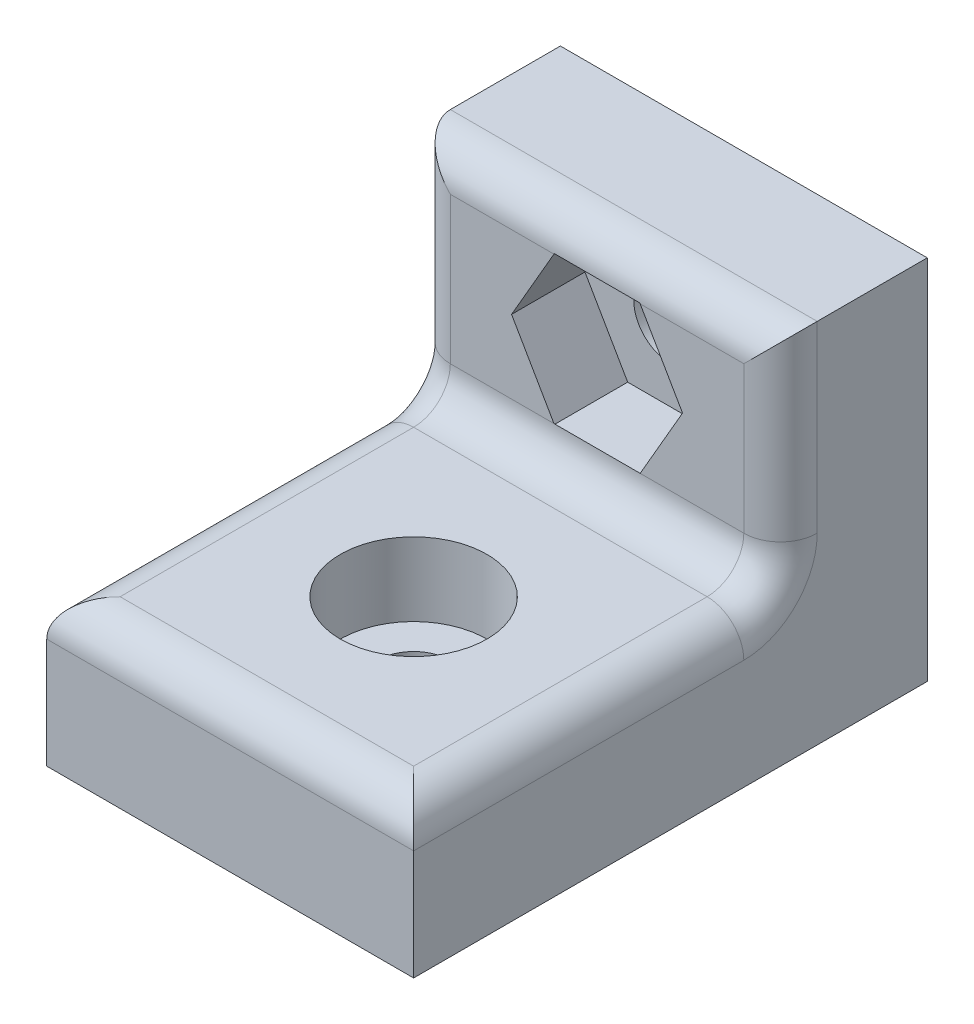
ISO-10303-21;
HEADER;
FILE_DESCRIPTION(('STEP AP214'),'2;1');
FILE_NAME('part.step','',(''),(''),'','','');
FILE_SCHEMA(('AUTOMOTIVE_DESIGN { 1 0 10303 214 1 1 1 1 }'));
ENDSEC;
DATA;
#1=APPLICATION_CONTEXT('core data for automotive mechanical design processes');
#2=APPLICATION_PROTOCOL_DEFINITION('international standard','automotive_design',2000,#1);
#3=PRODUCT_CONTEXT('',#1,'mechanical');
#4=PRODUCT('Part','Part','',(#3));
#5=PRODUCT_RELATED_PRODUCT_CATEGORY('part','',(#4));
#6=PRODUCT_DEFINITION_FORMATION('','',#4);
#7=PRODUCT_DEFINITION_CONTEXT('part definition',#1,'design');
#8=PRODUCT_DEFINITION('design','',#6,#7);
#9=PRODUCT_DEFINITION_SHAPE('','',#8);
#10=(LENGTH_UNIT() NAMED_UNIT(*) SI_UNIT(.MILLI.,.METRE.));
#11=(NAMED_UNIT(*) PLANE_ANGLE_UNIT() SI_UNIT($,.RADIAN.));
#12=(NAMED_UNIT(*) SI_UNIT($,.STERADIAN.) SOLID_ANGLE_UNIT());
#13=UNCERTAINTY_MEASURE_WITH_UNIT(LENGTH_MEASURE(1.E-05),#10,'distance_accuracy_value','');
#14=(GEOMETRIC_REPRESENTATION_CONTEXT(3) GLOBAL_UNCERTAINTY_ASSIGNED_CONTEXT((#13)) GLOBAL_UNIT_ASSIGNED_CONTEXT((#10,
#11,#12)) REPRESENTATION_CONTEXT('',''));
#15=CARTESIAN_POINT('',(0.,0.,0.));
#16=DIRECTION('',(0.,0.,1.));
#17=DIRECTION('',(1.,0.,0.));
#18=AXIS2_PLACEMENT_3D('',#15,#16,#17);
#19=CARTESIAN_POINT('',(0.,0.,9.));
#20=DIRECTION('',(0.,1.,0.));
#21=DIRECTION('',(0.,0.,1.));
#22=AXIS2_PLACEMENT_3D('',#19,#20,#21);
#23=CYLINDRICAL_SURFACE('',#22,1.);
#24=CARTESIAN_POINT('',(0.,0.,9.));
#25=DIRECTION('',(0.,1.,0.));
#26=DIRECTION('',(0.,0.,1.));
#27=AXIS2_PLACEMENT_3D('',#24,#25,#26);
#28=CIRCLE('',#27,1.);
#29=CARTESIAN_POINT('',(0.,0.,10.));
#30=VERTEX_POINT('',#29);
#31=EDGE_CURVE('E237',#30,#30,#28,.T.);
#32=ORIENTED_EDGE('',*,*,#31,.F.);
#33=EDGE_LOOP('',(#32));
#34=FACE_BOUND('',#33,.T.);
#35=CARTESIAN_POINT('',(0.,2.,9.));
#36=DIRECTION('',(0.,1.,0.));
#37=DIRECTION('',(0.,0.,1.));
#38=AXIS2_PLACEMENT_3D('',#35,#36,#37);
#39=CIRCLE('',#38,1.);
#40=CARTESIAN_POINT('',(0.,2.,10.));
#41=VERTEX_POINT('',#40);
#42=EDGE_CURVE('E42',#41,#41,#39,.F.);
#43=ORIENTED_EDGE('',*,*,#42,.F.);
#44=EDGE_LOOP('',(#43));
#45=FACE_BOUND('',#44,.T.);
#46=ADVANCED_FACE('F38',(#34,#45),#23,.F.);
#47=CARTESIAN_POINT('',(0.,0.,4.));
#48=DIRECTION('',(0.,0.,1.));
#49=DIRECTION('',(1.,0.,0.));
#50=AXIS2_PLACEMENT_3D('',#47,#48,#49);
#51=PLANE('',#50);
#52=DIRECTION('',(0.5,-0.866025403784439,0.));
#53=VECTOR('',#52,1.);
#54=CARTESIAN_POINT('',(-2.33,7.,4.));
#55=LINE('',#54,#53);
#56=CARTESIAN_POINT('',(-2.33,7.,4.));
#57=VERTEX_POINT('',#56);
#58=CARTESIAN_POINT('',(-1.17529946162075,5.,4.));
#59=VERTEX_POINT('',#58);
#60=EDGE_CURVE('E199',#57,#59,#55,.T.);
#61=ORIENTED_EDGE('',*,*,#60,.F.);
#62=DIRECTION('',(-0.5,-0.866025403784439,0.));
#63=VECTOR('',#62,1.);
#64=CARTESIAN_POINT('',(-1.165,9.01783919081774,4.));
#65=LINE('',#64,#63);
#66=CARTESIAN_POINT('',(-1.17529946162075,9.,4.));
#67=VERTEX_POINT('',#66);
#68=EDGE_CURVE('E220',#67,#57,#65,.T.);
#69=ORIENTED_EDGE('',*,*,#68,.F.);
#70=DIRECTION('',(-1.,0.,0.));
#71=VECTOR('',#70,1.);
#72=CARTESIAN_POINT('',(-5.,9.,4.));
#73=LINE('',#72,#71);
#74=CARTESIAN_POINT('',(-4.,9.,4.));
#75=VERTEX_POINT('',#74);
#76=EDGE_CURVE('E283',#67,#75,#73,.T.);
#77=ORIENTED_EDGE('',*,*,#76,.T.);
#78=DIRECTION('',(0.,-1.,0.));
#79=VECTOR('',#78,1.);
#80=CARTESIAN_POINT('',(-4.,4.,4.));
#81=LINE('',#80,#79);
#82=CARTESIAN_POINT('',(-4.,5.,4.));
#83=VERTEX_POINT('',#82);
#84=EDGE_CURVE('E278',#75,#83,#81,.T.);
#85=ORIENTED_EDGE('',*,*,#84,.T.);
#86=DIRECTION('',(-1.,0.,0.));
#87=VECTOR('',#86,1.);
#88=CARTESIAN_POINT('',(0.,5.,4.));
#89=LINE('',#88,#87);
#90=EDGE_CURVE('E275',#83,#59,#89,.F.);
#91=ORIENTED_EDGE('',*,*,#90,.T.);
#92=EDGE_LOOP('',(#61,#69,#77,#85,#91));
#93=FACE_BOUND('',#92,.T.);
#94=ADVANCED_FACE('F347',(#93),#51,.T.);
#95=CARTESIAN_POINT('',(0.,7.,0.));
#96=DIRECTION('',(0.,0.,1.));
#97=DIRECTION('',(1.,0.,0.));
#98=AXIS2_PLACEMENT_3D('',#95,#96,#97);
#99=CYLINDRICAL_SURFACE('',#98,1.);
#100=CARTESIAN_POINT('',(0.,7.,0.));
#101=DIRECTION('',(0.,0.,1.));
#102=DIRECTION('',(1.,0.,0.));
#103=AXIS2_PLACEMENT_3D('',#100,#101,#102);
#104=CIRCLE('',#103,1.);
#105=CARTESIAN_POINT('',(1.,7.,0.));
#106=VERTEX_POINT('',#105);
#107=EDGE_CURVE('E241',#106,#106,#104,.T.);
#108=ORIENTED_EDGE('',*,*,#107,.F.);
#109=EDGE_LOOP('',(#108));
#110=FACE_BOUND('',#109,.T.);
#111=CARTESIAN_POINT('',(0.,7.,2.));
#112=DIRECTION('',(0.,0.,1.));
#113=DIRECTION('',(1.,0.,0.));
#114=AXIS2_PLACEMENT_3D('',#111,#112,#113);
#115=CIRCLE('',#114,1.);
#116=CARTESIAN_POINT('',(1.,7.,2.));
#117=VERTEX_POINT('',#116);
#118=EDGE_CURVE('E236',#117,#117,#115,.F.);
#119=ORIENTED_EDGE('',*,*,#118,.F.);
#120=EDGE_LOOP('',(#119));
#121=FACE_BOUND('',#120,.T.);
#122=ADVANCED_FACE('F344',(#110,#121),#99,.F.);
#123=CARTESIAN_POINT('',(-5.,10.,4.));
#124=DIRECTION('',(1.,0.,0.));
#125=DIRECTION('',(0.,1.,0.));
#126=AXIS2_PLACEMENT_3D('',#123,#124,#125);
#127=PLANE('',#126);
#128=CARTESIAN_POINT('',(-5.,5.,5.));
#129=DIRECTION('',(1.,0.,0.));
#130=DIRECTION('',(0.,1.,0.));
#131=AXIS2_PLACEMENT_3D('',#128,#129,#130);
#132=CIRCLE('',#131,2.);
#133=CARTESIAN_POINT('',(-5.,5.,3.));
#134=VERTEX_POINT('',#133);
#135=CARTESIAN_POINT('',(-5.,3.,5.));
#136=VERTEX_POINT('',#135);
#137=EDGE_CURVE('E295',#134,#136,#132,.F.);
#138=ORIENTED_EDGE('',*,*,#137,.F.);
#139=DIRECTION('',(0.,-1.,0.));
#140=VECTOR('',#139,1.);
#141=CARTESIAN_POINT('',(-5.,10.,3.));
#142=LINE('',#141,#140);
#143=CARTESIAN_POINT('',(-5.,10.,3.));
#144=VERTEX_POINT('',#143);
#145=EDGE_CURVE('E300',#134,#144,#142,.F.);
#146=ORIENTED_EDGE('',*,*,#145,.T.);
#147=DIRECTION('',(0.,0.,-1.));
#148=VECTOR('',#147,1.);
#149=CARTESIAN_POINT('',(-5.,10.,4.));
#150=LINE('',#149,#148);
#151=CARTESIAN_POINT('',(-5.,10.,0.));
#152=VERTEX_POINT('',#151);
#153=EDGE_CURVE('E264',#144,#152,#150,.T.);
#154=ORIENTED_EDGE('',*,*,#153,.T.);
#155=DIRECTION('',(0.,-1.,0.));
#156=VECTOR('',#155,1.);
#157=CARTESIAN_POINT('',(-5.,10.,0.));
#158=LINE('',#157,#156);
#159=CARTESIAN_POINT('',(-5.,0.,0.));
#160=VERTEX_POINT('',#159);
#161=EDGE_CURVE('E253',#152,#160,#158,.T.);
#162=ORIENTED_EDGE('',*,*,#161,.T.);
#163=DIRECTION('',(0.,0.,-1.));
#164=VECTOR('',#163,1.);
#165=CARTESIAN_POINT('',(-5.,0.,4.));
#166=LINE('',#165,#164);
#167=CARTESIAN_POINT('',(-5.,0.,14.));
#168=VERTEX_POINT('',#167);
#169=EDGE_CURVE('E271',#168,#160,#166,.T.);
#170=ORIENTED_EDGE('',*,*,#169,.F.);
#171=DIRECTION('',(0.,-1.,0.));
#172=VECTOR('',#171,1.);
#173=CARTESIAN_POINT('',(-5.,0.,14.));
#174=LINE('',#173,#172);
#175=CARTESIAN_POINT('',(-5.,3.,14.));
#176=VERTEX_POINT('',#175);
#177=EDGE_CURVE('E244',#176,#168,#174,.T.);
#178=ORIENTED_EDGE('',*,*,#177,.F.);
#179=DIRECTION('',(0.,0.,-1.));
#180=VECTOR('',#179,1.);
#181=CARTESIAN_POINT('',(-5.,3.,4.));
#182=LINE('',#181,#180);
#183=EDGE_CURVE('E298',#176,#136,#182,.T.);
#184=ORIENTED_EDGE('',*,*,#183,.T.);
#185=EDGE_LOOP('',(#138,#146,#154,#162,#170,#178,#184));
#186=FACE_BOUND('',#185,.T.);
#187=ADVANCED_FACE('F346',(#186),#127,.F.);
#188=CARTESIAN_POINT('',(-5.,0.,4.));
#189=DIRECTION('',(0.,1.,0.));
#190=DIRECTION('',(0.,0.,1.));
#191=AXIS2_PLACEMENT_3D('',#188,#189,#190);
#192=PLANE('',#191);
#193=ORIENTED_EDGE('',*,*,#31,.T.);
#194=EDGE_LOOP('',(#193));
#195=FACE_BOUND('',#194,.T.);
#196=DIRECTION('',(1.,0.,0.));
#197=VECTOR('',#196,1.);
#198=CARTESIAN_POINT('',(-5.,0.,0.));
#199=LINE('',#198,#197);
#200=CARTESIAN_POINT('',(5.,0.,0.));
#201=VERTEX_POINT('',#200);
#202=EDGE_CURVE('E256',#160,#201,#199,.T.);
#203=ORIENTED_EDGE('',*,*,#202,.T.);
#204=DIRECTION('',(0.,0.,-1.));
#205=VECTOR('',#204,1.);
#206=CARTESIAN_POINT('',(5.,0.,4.));
#207=LINE('',#206,#205);
#208=CARTESIAN_POINT('',(5.,0.,14.));
#209=VERTEX_POINT('',#208);
#210=EDGE_CURVE('E268',#209,#201,#207,.T.);
#211=ORIENTED_EDGE('',*,*,#210,.F.);
#212=DIRECTION('',(1.,0.,0.));
#213=VECTOR('',#212,1.);
#214=CARTESIAN_POINT('',(-5.,0.,14.));
#215=LINE('',#214,#213);
#216=EDGE_CURVE('E247',#168,#209,#215,.T.);
#217=ORIENTED_EDGE('',*,*,#216,.F.);
#218=ORIENTED_EDGE('',*,*,#169,.T.);
#219=EDGE_LOOP('',(#203,#211,#217,#218));
#220=FACE_BOUND('',#219,.T.);
#221=ADVANCED_FACE('F354',(#195,#220),#192,.F.);
#222=CARTESIAN_POINT('',(5.,10.,4.));
#223=DIRECTION('',(-1.,0.,0.));
#224=DIRECTION('',(0.,-1.,0.));
#225=AXIS2_PLACEMENT_3D('',#222,#223,#224);
#226=PLANE('',#225);
#227=DIRECTION('',(0.,0.,-1.));
#228=VECTOR('',#227,1.);
#229=CARTESIAN_POINT('',(5.,10.,4.));
#230=LINE('',#229,#228);
#231=CARTESIAN_POINT('',(5.,10.,3.));
#232=VERTEX_POINT('',#231);
#233=CARTESIAN_POINT('',(5.,10.,0.));
#234=VERTEX_POINT('',#233);
#235=EDGE_CURVE('E266',#232,#234,#230,.T.);
#236=ORIENTED_EDGE('',*,*,#235,.F.);
#237=DIRECTION('',(0.,1.,0.));
#238=VECTOR('',#237,1.);
#239=CARTESIAN_POINT('',(5.,4.,3.));
#240=LINE('',#239,#238);
#241=CARTESIAN_POINT('',(5.,5.,3.));
#242=VERTEX_POINT('',#241);
#243=EDGE_CURVE('E292',#232,#242,#240,.F.);
#244=ORIENTED_EDGE('',*,*,#243,.T.);
#245=CARTESIAN_POINT('',(5.,5.,5.));
#246=DIRECTION('',(-1.,0.,0.));
#247=DIRECTION('',(0.,-1.,0.));
#248=AXIS2_PLACEMENT_3D('',#245,#246,#247);
#249=CIRCLE('',#248,2.);
#250=CARTESIAN_POINT('',(5.,3.,5.));
#251=VERTEX_POINT('',#250);
#252=EDGE_CURVE('E289',#251,#242,#249,.F.);
#253=ORIENTED_EDGE('',*,*,#252,.F.);
#254=DIRECTION('',(0.,0.,-1.));
#255=VECTOR('',#254,1.);
#256=CARTESIAN_POINT('',(5.,3.,4.));
#257=LINE('',#256,#255);
#258=CARTESIAN_POINT('',(5.,3.,14.));
#259=VERTEX_POINT('',#258);
#260=EDGE_CURVE('E287',#251,#259,#257,.F.);
#261=ORIENTED_EDGE('',*,*,#260,.T.);
#262=DIRECTION('',(0.,1.,0.));
#263=VECTOR('',#262,1.);
#264=CARTESIAN_POINT('',(5.,0.,14.));
#265=LINE('',#264,#263);
#266=EDGE_CURVE('E250',#209,#259,#265,.T.);
#267=ORIENTED_EDGE('',*,*,#266,.F.);
#268=ORIENTED_EDGE('',*,*,#210,.T.);
#269=DIRECTION('',(0.,1.,0.));
#270=VECTOR('',#269,1.);
#271=CARTESIAN_POINT('',(5.,10.,0.));
#272=LINE('',#271,#270);
#273=EDGE_CURVE('E258',#201,#234,#272,.T.);
#274=ORIENTED_EDGE('',*,*,#273,.T.);
#275=EDGE_LOOP('',(#236,#244,#253,#261,#267,#268,#274));
#276=FACE_BOUND('',#275,.T.);
#277=ADVANCED_FACE('F456',(#276),#226,.F.);
#278=CARTESIAN_POINT('',(-5.,10.,4.));
#279=DIRECTION('',(0.,-1.,0.));
#280=DIRECTION('',(0.,0.,-1.));
#281=AXIS2_PLACEMENT_3D('',#278,#279,#280);
#282=PLANE('',#281);
#283=ORIENTED_EDGE('',*,*,#153,.F.);
#284=DIRECTION('',(-1.,0.,0.));
#285=VECTOR('',#284,1.);
#286=CARTESIAN_POINT('',(5.,10.,3.));
#287=LINE('',#286,#285);
#288=EDGE_CURVE('E302',#144,#232,#287,.F.);
#289=ORIENTED_EDGE('',*,*,#288,.T.);
#290=ORIENTED_EDGE('',*,*,#235,.T.);
#291=DIRECTION('',(-1.,0.,0.));
#292=VECTOR('',#291,1.);
#293=CARTESIAN_POINT('',(-5.,10.,0.));
#294=LINE('',#293,#292);
#295=EDGE_CURVE('E261',#234,#152,#294,.T.);
#296=ORIENTED_EDGE('',*,*,#295,.T.);
#297=EDGE_LOOP('',(#283,#289,#290,#296));
#298=FACE_BOUND('',#297,.T.);
#299=ADVANCED_FACE('F463',(#298),#282,.F.);
#300=DIRECTION('',(-0.5,0.866025403784439,0.));
#301=VECTOR('',#300,1.);
#302=CARTESIAN_POINT('',(2.33,7.,4.));
#303=LINE('',#302,#301);
#304=CARTESIAN_POINT('',(2.33,7.,4.));
#305=VERTEX_POINT('',#304);
#306=CARTESIAN_POINT('',(1.17529946162075,9.,4.));
#307=VERTEX_POINT('',#306);
#308=EDGE_CURVE('E55',#305,#307,#303,.T.);
#309=ORIENTED_EDGE('',*,*,#308,.F.);
#310=DIRECTION('',(0.5,0.866025403784439,0.));
#311=VECTOR('',#310,1.);
#312=CARTESIAN_POINT('',(1.165,4.98216080918226,4.));
#313=LINE('',#312,#311);
#314=CARTESIAN_POINT('',(1.17529946162075,5.,4.));
#315=VERTEX_POINT('',#314);
#316=EDGE_CURVE('E216',#315,#305,#313,.T.);
#317=ORIENTED_EDGE('',*,*,#316,.F.);
#318=CARTESIAN_POINT('',(4.,5.,4.));
#319=VERTEX_POINT('',#318);
#320=EDGE_CURVE('E274',#315,#319,#89,.F.);
#321=ORIENTED_EDGE('',*,*,#320,.T.);
#322=DIRECTION('',(0.,1.,0.));
#323=VECTOR('',#322,1.);
#324=CARTESIAN_POINT('',(4.,10.,4.));
#325=LINE('',#324,#323);
#326=CARTESIAN_POINT('',(4.,9.,4.));
#327=VERTEX_POINT('',#326);
#328=EDGE_CURVE('E280',#319,#327,#325,.T.);
#329=ORIENTED_EDGE('',*,*,#328,.T.);
#330=EDGE_CURVE('E284',#327,#307,#73,.T.);
#331=ORIENTED_EDGE('',*,*,#330,.T.);
#332=EDGE_LOOP('',(#309,#317,#321,#329,#331));
#333=FACE_BOUND('',#332,.T.);
#334=ADVANCED_FACE('F359',(#333),#51,.T.);
#335=CARTESIAN_POINT('',(0.,0.,0.));
#336=DIRECTION('',(0.,0.,1.));
#337=DIRECTION('',(1.,0.,0.));
#338=AXIS2_PLACEMENT_3D('',#335,#336,#337);
#339=PLANE('',#338);
#340=ORIENTED_EDGE('',*,*,#107,.T.);
#341=EDGE_LOOP('',(#340));
#342=FACE_BOUND('',#341,.T.);
#343=ORIENTED_EDGE('',*,*,#161,.F.);
#344=ORIENTED_EDGE('',*,*,#295,.F.);
#345=ORIENTED_EDGE('',*,*,#273,.F.);
#346=ORIENTED_EDGE('',*,*,#202,.F.);
#347=EDGE_LOOP('',(#343,#344,#345,#346));
#348=FACE_BOUND('',#347,.T.);
#349=ADVANCED_FACE('F419',(#342,#348),#339,.F.);
#350=CARTESIAN_POINT('',(-5.,4.,14.));
#351=DIRECTION('',(0.,-1.,0.));
#352=DIRECTION('',(0.,0.,-1.));
#353=AXIS2_PLACEMENT_3D('',#350,#351,#352);
#354=PLANE('',#353);
#355=CARTESIAN_POINT('',(0.,4.,9.));
#356=DIRECTION('',(0.,1.,0.));
#357=DIRECTION('',(0.,0.,1.));
#358=AXIS2_PLACEMENT_3D('',#355,#356,#357);
#359=CIRCLE('',#358,2.);
#360=CARTESIAN_POINT('',(0.,4.,11.));
#361=VERTEX_POINT('',#360);
#362=EDGE_CURVE('E205',#361,#361,#359,.T.);
#363=ORIENTED_EDGE('',*,*,#362,.F.);
#364=EDGE_LOOP('',(#363));
#365=FACE_BOUND('',#364,.T.);
#366=DIRECTION('',(0.,0.,-1.));
#367=VECTOR('',#366,1.);
#368=CARTESIAN_POINT('',(-4.,4.,14.));
#369=LINE('',#368,#367);
#370=CARTESIAN_POINT('',(-4.,4.,5.));
#371=VERTEX_POINT('',#370);
#372=CARTESIAN_POINT('',(-4.,4.,13.));
#373=VERTEX_POINT('',#372);
#374=EDGE_CURVE('E308',#371,#373,#369,.F.);
#375=ORIENTED_EDGE('',*,*,#374,.T.);
#376=DIRECTION('',(-1.,0.,0.));
#377=VECTOR('',#376,1.);
#378=CARTESIAN_POINT('',(-5.,4.,13.));
#379=LINE('',#378,#377);
#380=CARTESIAN_POINT('',(4.,4.,13.));
#381=VERTEX_POINT('',#380);
#382=EDGE_CURVE('E311',#373,#381,#379,.F.);
#383=ORIENTED_EDGE('',*,*,#382,.T.);
#384=DIRECTION('',(0.,0.,-1.));
#385=VECTOR('',#384,1.);
#386=CARTESIAN_POINT('',(4.,4.,14.));
#387=LINE('',#386,#385);
#388=CARTESIAN_POINT('',(4.,4.,5.));
#389=VERTEX_POINT('',#388);
#390=EDGE_CURVE('E63',#381,#389,#387,.T.);
#391=ORIENTED_EDGE('',*,*,#390,.T.);
#392=DIRECTION('',(-1.,0.,0.));
#393=VECTOR('',#392,1.);
#394=CARTESIAN_POINT('',(-5.,4.,5.));
#395=LINE('',#394,#393);
#396=EDGE_CURVE('E306',#389,#371,#395,.T.);
#397=ORIENTED_EDGE('',*,*,#396,.T.);
#398=EDGE_LOOP('',(#375,#383,#391,#397));
#399=FACE_BOUND('',#398,.T.);
#400=ADVANCED_FACE('F415',(#365,#399),#354,.F.);
#401=CARTESIAN_POINT('',(0.,0.,14.));
#402=DIRECTION('',(0.,0.,-1.));
#403=DIRECTION('',(-1.,0.,0.));
#404=AXIS2_PLACEMENT_3D('',#401,#402,#403);
#405=PLANE('',#404);
#406=ORIENTED_EDGE('',*,*,#266,.T.);
#407=DIRECTION('',(-1.,0.,0.));
#408=VECTOR('',#407,1.);
#409=CARTESIAN_POINT('',(0.,3.,14.));
#410=LINE('',#409,#408);
#411=EDGE_CURVE('E304',#259,#176,#410,.T.);
#412=ORIENTED_EDGE('',*,*,#411,.T.);
#413=ORIENTED_EDGE('',*,*,#177,.T.);
#414=ORIENTED_EDGE('',*,*,#216,.T.);
#415=EDGE_LOOP('',(#406,#412,#413,#414));
#416=FACE_BOUND('',#415,.T.);
#417=ADVANCED_FACE('F418',(#416),#405,.F.);
#418=CARTESIAN_POINT('',(-4.,3.,4.));
#419=DIRECTION('',(0.,0.,-1.));
#420=DIRECTION('',(-1.,0.,0.));
#421=AXIS2_PLACEMENT_3D('',#418,#419,#420);
#422=CYLINDRICAL_SURFACE('',#421,1.);
#423=CARTESIAN_POINT('',(-4.,3.,5.));
#424=DIRECTION('',(0.,0.,-1.));
#425=DIRECTION('',(-1.,0.,0.));
#426=AXIS2_PLACEMENT_3D('',#423,#424,#425);
#427=CIRCLE('',#426,1.);
#428=EDGE_CURVE('E335',#136,#371,#427,.T.);
#429=ORIENTED_EDGE('',*,*,#428,.F.);
#430=ORIENTED_EDGE('',*,*,#183,.F.);
#431=CARTESIAN_POINT('',(-4.,3.,13.));
#432=DIRECTION('',(-0.707106781186547,0.,-0.707106781186547));
#433=DIRECTION('',(0.707106781186547,0.,-0.707106781186547));
#434=AXIS2_PLACEMENT_3D('',#431,#432,#433);
#435=ELLIPSE('',#434,1.41421356237309,1.);
#436=EDGE_CURVE('E245',#373,#176,#435,.F.);
#437=ORIENTED_EDGE('',*,*,#436,.F.);
#438=ORIENTED_EDGE('',*,*,#374,.F.);
#439=EDGE_LOOP('',(#429,#430,#437,#438));
#440=FACE_BOUND('',#439,.T.);
#441=ADVANCED_FACE('F40',(#440),#422,.T.);
#442=CARTESIAN_POINT('',(0.,3.,13.));
#443=DIRECTION('',(-1.,0.,0.));
#444=DIRECTION('',(0.,0.,1.));
#445=AXIS2_PLACEMENT_3D('',#442,#443,#444);
#446=CYLINDRICAL_SURFACE('',#445,1.);
#447=ORIENTED_EDGE('',*,*,#436,.T.);
#448=ORIENTED_EDGE('',*,*,#411,.F.);
#449=CARTESIAN_POINT('',(4.,3.,13.));
#450=DIRECTION('',(0.707106781186547,0.,-0.707106781186547));
#451=DIRECTION('',(-0.707106781186547,0.,-0.707106781186547));
#452=AXIS2_PLACEMENT_3D('',#449,#450,#451);
#453=ELLIPSE('',#452,1.41421356237309,1.);
#454=EDGE_CURVE('E333',#381,#259,#453,.T.);
#455=ORIENTED_EDGE('',*,*,#454,.F.);
#456=ORIENTED_EDGE('',*,*,#382,.F.);
#457=EDGE_LOOP('',(#447,#448,#455,#456));
#458=FACE_BOUND('',#457,.T.);
#459=ADVANCED_FACE('F430',(#458),#446,.T.);
#460=CARTESIAN_POINT('',(-4.,5.,5.));
#461=DIRECTION('',(1.,0.,0.));
#462=DIRECTION('',(0.,1.,0.));
#463=AXIS2_PLACEMENT_3D('',#460,#461,#462);
#464=TOROIDAL_SURFACE('',#463,2.,1.);
#465=ORIENTED_EDGE('',*,*,#137,.T.);
#466=ORIENTED_EDGE('',*,*,#428,.T.);
#467=CARTESIAN_POINT('',(-4.,5.,5.));
#468=DIRECTION('',(1.,0.,0.));
#469=DIRECTION('',(0.,1.,0.));
#470=AXIS2_PLACEMENT_3D('',#467,#468,#469);
#471=CIRCLE('',#470,1.);
#472=EDGE_CURVE('E330',#83,#371,#471,.F.);
#473=ORIENTED_EDGE('',*,*,#472,.F.);
#474=CARTESIAN_POINT('',(-4.,5.,3.));
#475=DIRECTION('',(0.,-1.,0.));
#476=DIRECTION('',(0.,0.,-1.));
#477=AXIS2_PLACEMENT_3D('',#474,#475,#476);
#478=CIRCLE('',#477,1.);
#479=EDGE_CURVE('E327',#134,#83,#478,.F.);
#480=ORIENTED_EDGE('',*,*,#479,.F.);
#481=EDGE_LOOP('',(#465,#466,#473,#480));
#482=FACE_BOUND('',#481,.T.);
#483=ADVANCED_FACE('F448',(#482),#464,.T.);
#484=CARTESIAN_POINT('',(4.,3.,14.));
#485=DIRECTION('',(0.,0.,-1.));
#486=DIRECTION('',(-1.,0.,0.));
#487=AXIS2_PLACEMENT_3D('',#484,#485,#486);
#488=CYLINDRICAL_SURFACE('',#487,1.);
#489=ORIENTED_EDGE('',*,*,#454,.T.);
#490=ORIENTED_EDGE('',*,*,#260,.F.);
#491=CARTESIAN_POINT('',(4.,3.,5.));
#492=DIRECTION('',(0.,0.,-1.));
#493=DIRECTION('',(-1.,0.,0.));
#494=AXIS2_PLACEMENT_3D('',#491,#492,#493);
#495=CIRCLE('',#494,1.);
#496=EDGE_CURVE('E324',#389,#251,#495,.T.);
#497=ORIENTED_EDGE('',*,*,#496,.F.);
#498=ORIENTED_EDGE('',*,*,#390,.F.);
#499=EDGE_LOOP('',(#489,#490,#497,#498));
#500=FACE_BOUND('',#499,.T.);
#501=ADVANCED_FACE('F432',(#500),#488,.T.);
#502=CARTESIAN_POINT('',(-5.,5.,5.));
#503=DIRECTION('',(-1.,0.,0.));
#504=DIRECTION('',(0.,0.,1.));
#505=AXIS2_PLACEMENT_3D('',#502,#503,#504);
#506=CYLINDRICAL_SURFACE('',#505,1.);
#507=ORIENTED_EDGE('',*,*,#472,.T.);
#508=ORIENTED_EDGE('',*,*,#396,.F.);
#509=CARTESIAN_POINT('',(4.,5.,5.));
#510=DIRECTION('',(-1.,0.,0.));
#511=DIRECTION('',(0.,-1.,0.));
#512=AXIS2_PLACEMENT_3D('',#509,#510,#511);
#513=CIRCLE('',#512,1.);
#514=EDGE_CURVE('E321',#319,#389,#513,.T.);
#515=ORIENTED_EDGE('',*,*,#514,.F.);
#516=ORIENTED_EDGE('',*,*,#320,.F.);
#517=DIRECTION('',(-1.,0.,0.));
#518=VECTOR('',#517,1.);
#519=CARTESIAN_POINT('',(-5.,5.,4.));
#520=LINE('',#519,#518);
#521=EDGE_CURVE('E224',#59,#315,#520,.F.);
#522=ORIENTED_EDGE('',*,*,#521,.F.);
#523=ORIENTED_EDGE('',*,*,#90,.F.);
#524=EDGE_LOOP('',(#507,#508,#515,#516,#522,#523));
#525=FACE_BOUND('',#524,.T.);
#526=ADVANCED_FACE('F442',(#525),#506,.F.);
#527=CARTESIAN_POINT('',(-4.,0.,3.));
#528=DIRECTION('',(0.,1.,0.));
#529=DIRECTION('',(-1.,0.,0.));
#530=AXIS2_PLACEMENT_3D('',#527,#528,#529);
#531=CYLINDRICAL_SURFACE('',#530,1.);
#532=ORIENTED_EDGE('',*,*,#479,.T.);
#533=ORIENTED_EDGE('',*,*,#84,.F.);
#534=CARTESIAN_POINT('',(-4.,9.,3.));
#535=DIRECTION('',(0.707106781186547,0.707106781186548,0.));
#536=DIRECTION('',(0.707106781186548,-0.707106781186547,0.));
#537=AXIS2_PLACEMENT_3D('',#534,#535,#536);
#538=ELLIPSE('',#537,1.4142135623731,1.);
#539=EDGE_CURVE('E318',#144,#75,#538,.T.);
#540=ORIENTED_EDGE('',*,*,#539,.F.);
#541=ORIENTED_EDGE('',*,*,#145,.F.);
#542=EDGE_LOOP('',(#532,#533,#540,#541));
#543=FACE_BOUND('',#542,.T.);
#544=ADVANCED_FACE('F483',(#543),#531,.T.);
#545=CARTESIAN_POINT('',(4.,5.,5.));
#546=DIRECTION('',(-1.,0.,0.));
#547=DIRECTION('',(0.,-1.,0.));
#548=AXIS2_PLACEMENT_3D('',#545,#546,#547);
#549=TOROIDAL_SURFACE('',#548,2.,1.);
#550=ORIENTED_EDGE('',*,*,#496,.T.);
#551=ORIENTED_EDGE('',*,*,#252,.T.);
#552=CARTESIAN_POINT('',(4.,5.,3.));
#553=DIRECTION('',(0.,-1.,0.));
#554=DIRECTION('',(0.,0.,-1.));
#555=AXIS2_PLACEMENT_3D('',#552,#553,#554);
#556=CIRCLE('',#555,1.);
#557=EDGE_CURVE('E316',#319,#242,#556,.F.);
#558=ORIENTED_EDGE('',*,*,#557,.F.);
#559=ORIENTED_EDGE('',*,*,#514,.T.);
#560=EDGE_LOOP('',(#550,#551,#558,#559));
#561=FACE_BOUND('',#560,.T.);
#562=ADVANCED_FACE('F436',(#561),#549,.T.);
#563=CARTESIAN_POINT('',(0.,9.,3.));
#564=DIRECTION('',(1.,0.,0.));
#565=DIRECTION('',(0.,0.,-1.));
#566=AXIS2_PLACEMENT_3D('',#563,#564,#565);
#567=CYLINDRICAL_SURFACE('',#566,1.);
#568=CARTESIAN_POINT('',(-1.17529946162075,9.,3.));
#569=DIRECTION('',(-0.866025403784439,0.5,0.));
#570=DIRECTION('',(0.5,0.866025403784439,0.));
#571=AXIS2_PLACEMENT_3D('',#568,#569,#570);
#572=ELLIPSE('',#571,1.15470053837925,1.);
#573=CARTESIAN_POINT('',(-1.165,9.01783919081774,3.99984086897414));
#574=VERTEX_POINT('',#573);
#575=EDGE_CURVE('E12',#574,#67,#572,.F.);
#576=ORIENTED_EDGE('',*,*,#575,.F.);
#577=DIRECTION('',(1.,0.,0.));
#578=VECTOR('',#577,1.);
#579=CARTESIAN_POINT('',(0.,9.01783919081774,3.99984086897414));
#580=LINE('',#579,#578);
#581=CARTESIAN_POINT('',(1.165,9.01783919081774,3.99984086897414));
#582=VERTEX_POINT('',#581);
#583=EDGE_CURVE('E47',#582,#574,#580,.F.);
#584=ORIENTED_EDGE('',*,*,#583,.F.);
#585=CARTESIAN_POINT('',(1.17529946162075,9.,3.));
#586=DIRECTION('',(0.866025403784439,0.5,0.));
#587=DIRECTION('',(0.5,-0.866025403784439,0.));
#588=AXIS2_PLACEMENT_3D('',#585,#586,#587);
#589=ELLIPSE('',#588,1.15470053837925,1.);
#590=EDGE_CURVE('E314',#307,#582,#589,.F.);
#591=ORIENTED_EDGE('',*,*,#590,.F.);
#592=ORIENTED_EDGE('',*,*,#330,.F.);
#593=CARTESIAN_POINT('',(4.,9.,3.));
#594=DIRECTION('',(0.707106781186547,-0.707106781186547,0.));
#595=DIRECTION('',(0.707106781186547,0.707106781186548,0.));
#596=AXIS2_PLACEMENT_3D('',#593,#594,#595);
#597=ELLIPSE('',#596,1.41421356237309,1.);
#598=EDGE_CURVE('E240',#232,#327,#597,.T.);
#599=ORIENTED_EDGE('',*,*,#598,.F.);
#600=ORIENTED_EDGE('',*,*,#288,.F.);
#601=ORIENTED_EDGE('',*,*,#539,.T.);
#602=ORIENTED_EDGE('',*,*,#76,.F.);
#603=EDGE_LOOP('',(#576,#584,#591,#592,#599,#600,#601,#602));
#604=FACE_BOUND('',#603,.T.);
#605=ADVANCED_FACE('F472',(#604),#567,.T.);
#606=CARTESIAN_POINT('',(4.,0.,3.));
#607=DIRECTION('',(0.,-1.,0.));
#608=DIRECTION('',(1.,0.,0.));
#609=AXIS2_PLACEMENT_3D('',#606,#607,#608);
#610=CYLINDRICAL_SURFACE('',#609,1.);
#611=ORIENTED_EDGE('',*,*,#557,.T.);
#612=ORIENTED_EDGE('',*,*,#243,.F.);
#613=ORIENTED_EDGE('',*,*,#598,.T.);
#614=ORIENTED_EDGE('',*,*,#328,.F.);
#615=EDGE_LOOP('',(#611,#612,#613,#614));
#616=FACE_BOUND('',#615,.T.);
#617=ADVANCED_FACE('F396',(#616),#610,.T.);
#618=CARTESIAN_POINT('',(0.,0.,2.));
#619=DIRECTION('',(0.,0.,1.));
#620=DIRECTION('',(1.,0.,0.));
#621=AXIS2_PLACEMENT_3D('',#618,#619,#620);
#622=PLANE('',#621);
#623=DIRECTION('',(1.,0.,0.));
#624=VECTOR('',#623,1.);
#625=CARTESIAN_POINT('',(-1.165,4.98216080918226,2.));
#626=LINE('',#625,#624);
#627=CARTESIAN_POINT('',(-1.165,4.98216080918226,2.));
#628=VERTEX_POINT('',#627);
#629=CARTESIAN_POINT('',(1.165,4.98216080918226,2.));
#630=VERTEX_POINT('',#629);
#631=EDGE_CURVE('E177',#628,#630,#626,.T.);
#632=ORIENTED_EDGE('',*,*,#631,.T.);
#633=DIRECTION('',(0.5,0.866025403784439,0.));
#634=VECTOR('',#633,1.);
#635=CARTESIAN_POINT('',(1.165,4.98216080918226,2.));
#636=LINE('',#635,#634);
#637=CARTESIAN_POINT('',(2.33,7.,2.));
#638=VERTEX_POINT('',#637);
#639=EDGE_CURVE('E188',#630,#638,#636,.T.);
#640=ORIENTED_EDGE('',*,*,#639,.T.);
#641=DIRECTION('',(-0.5,0.866025403784439,0.));
#642=VECTOR('',#641,1.);
#643=CARTESIAN_POINT('',(2.33,7.,2.));
#644=LINE('',#643,#642);
#645=CARTESIAN_POINT('',(1.165,9.01783919081774,2.));
#646=VERTEX_POINT('',#645);
#647=EDGE_CURVE('E193',#638,#646,#644,.T.);
#648=ORIENTED_EDGE('',*,*,#647,.T.);
#649=DIRECTION('',(-1.,0.,0.));
#650=VECTOR('',#649,1.);
#651=CARTESIAN_POINT('',(1.165,9.01783919081774,2.));
#652=LINE('',#651,#650);
#653=CARTESIAN_POINT('',(-1.165,9.01783919081774,2.));
#654=VERTEX_POINT('',#653);
#655=EDGE_CURVE('E209',#646,#654,#652,.T.);
#656=ORIENTED_EDGE('',*,*,#655,.T.);
#657=DIRECTION('',(-0.5,-0.866025403784439,0.));
#658=VECTOR('',#657,1.);
#659=CARTESIAN_POINT('',(-1.165,9.01783919081774,2.));
#660=LINE('',#659,#658);
#661=CARTESIAN_POINT('',(-2.33,7.,2.));
#662=VERTEX_POINT('',#661);
#663=EDGE_CURVE('E212',#654,#662,#660,.T.);
#664=ORIENTED_EDGE('',*,*,#663,.T.);
#665=DIRECTION('',(0.5,-0.866025403784439,0.));
#666=VECTOR('',#665,1.);
#667=CARTESIAN_POINT('',(-2.33,7.,2.));
#668=LINE('',#667,#666);
#669=EDGE_CURVE('E185',#662,#628,#668,.T.);
#670=ORIENTED_EDGE('',*,*,#669,.T.);
#671=EDGE_LOOP('',(#632,#640,#648,#656,#664,#670));
#672=FACE_BOUND('',#671,.T.);
#673=ORIENTED_EDGE('',*,*,#118,.T.);
#674=EDGE_LOOP('',(#673));
#675=FACE_BOUND('',#674,.T.);
#676=ADVANCED_FACE('F195',(#672,#675),#622,.T.);
#677=CARTESIAN_POINT('',(0.,0.,4.));
#678=DIRECTION('',(0.,0.,1.));
#679=DIRECTION('',(1.,0.,0.));
#680=AXIS2_PLACEMENT_3D('',#677,#678,#679);
#681=PLANE('',#680);
#682=ORIENTED_EDGE('',*,*,#521,.T.);
#683=CARTESIAN_POINT('',(1.165,4.98216080918226,4.));
#684=VERTEX_POINT('',#683);
#685=EDGE_CURVE('E217',#684,#315,#313,.T.);
#686=ORIENTED_EDGE('',*,*,#685,.F.);
#687=DIRECTION('',(1.,0.,0.));
#688=VECTOR('',#687,1.);
#689=CARTESIAN_POINT('',(-1.165,4.98216080918226,4.));
#690=LINE('',#689,#688);
#691=CARTESIAN_POINT('',(-1.165,4.98216080918226,4.));
#692=VERTEX_POINT('',#691);
#693=EDGE_CURVE('E180',#692,#684,#690,.T.);
#694=ORIENTED_EDGE('',*,*,#693,.F.);
#695=EDGE_CURVE('E202',#59,#692,#55,.T.);
#696=ORIENTED_EDGE('',*,*,#695,.F.);
#697=EDGE_LOOP('',(#682,#686,#694,#696));
#698=FACE_BOUND('',#697,.T.);
#699=ADVANCED_FACE('F373',(#698),#681,.F.);
#700=CARTESIAN_POINT('',(-1.165,4.98216080918226,2.));
#701=DIRECTION('',(0.,-1.,0.));
#702=DIRECTION('',(0.,0.,-1.));
#703=AXIS2_PLACEMENT_3D('',#700,#701,#702);
#704=PLANE('',#703);
#705=ORIENTED_EDGE('',*,*,#693,.T.);
#706=DIRECTION('',(0.,0.,1.));
#707=VECTOR('',#706,1.);
#708=CARTESIAN_POINT('',(1.165,4.98216080918226,2.));
#709=LINE('',#708,#707);
#710=EDGE_CURVE('E172',#630,#684,#709,.T.);
#711=ORIENTED_EDGE('',*,*,#710,.F.);
#712=ORIENTED_EDGE('',*,*,#631,.F.);
#713=DIRECTION('',(0.,0.,1.));
#714=VECTOR('',#713,1.);
#715=CARTESIAN_POINT('',(-1.165,4.98216080918226,2.));
#716=LINE('',#715,#714);
#717=EDGE_CURVE('E222',#628,#692,#716,.T.);
#718=ORIENTED_EDGE('',*,*,#717,.T.);
#719=EDGE_LOOP('',(#705,#711,#712,#718));
#720=FACE_BOUND('',#719,.T.);
#721=ADVANCED_FACE('F174',(#720),#704,.F.);
#722=CARTESIAN_POINT('',(-2.33,7.,2.));
#723=DIRECTION('',(-0.866025403784439,-0.5,0.));
#724=DIRECTION('',(0.5,-0.866025403784439,0.));
#725=AXIS2_PLACEMENT_3D('',#722,#723,#724);
#726=PLANE('',#725);
#727=ORIENTED_EDGE('',*,*,#60,.T.);
#728=ORIENTED_EDGE('',*,*,#695,.T.);
#729=ORIENTED_EDGE('',*,*,#717,.F.);
#730=ORIENTED_EDGE('',*,*,#669,.F.);
#731=DIRECTION('',(0.,0.,1.));
#732=VECTOR('',#731,1.);
#733=CARTESIAN_POINT('',(-2.33,7.,2.));
#734=LINE('',#733,#732);
#735=EDGE_CURVE('E225',#662,#57,#734,.T.);
#736=ORIENTED_EDGE('',*,*,#735,.T.);
#737=EDGE_LOOP('',(#727,#728,#729,#730,#736));
#738=FACE_BOUND('',#737,.T.);
#739=ADVANCED_FACE('F372',(#738),#726,.F.);
#740=CARTESIAN_POINT('',(-1.165,9.01783919081774,2.));
#741=DIRECTION('',(-0.866025403784439,0.5,0.));
#742=DIRECTION('',(-0.5,-0.866025403784439,0.));
#743=AXIS2_PLACEMENT_3D('',#740,#741,#742);
#744=PLANE('',#743);
#745=ORIENTED_EDGE('',*,*,#575,.T.);
#746=ORIENTED_EDGE('',*,*,#68,.T.);
#747=ORIENTED_EDGE('',*,*,#735,.F.);
#748=ORIENTED_EDGE('',*,*,#663,.F.);
#749=DIRECTION('',(0.,0.,1.));
#750=VECTOR('',#749,1.);
#751=CARTESIAN_POINT('',(-1.165,9.01783919081774,2.));
#752=LINE('',#751,#750);
#753=EDGE_CURVE('E228',#654,#574,#752,.T.);
#754=ORIENTED_EDGE('',*,*,#753,.T.);
#755=EDGE_LOOP('',(#745,#746,#747,#748,#754));
#756=FACE_BOUND('',#755,.T.);
#757=ADVANCED_FACE('F383',(#756),#744,.F.);
#758=CARTESIAN_POINT('',(1.165,9.01783919081774,2.));
#759=DIRECTION('',(0.,1.,0.));
#760=DIRECTION('',(0.,0.,1.));
#761=AXIS2_PLACEMENT_3D('',#758,#759,#760);
#762=PLANE('',#761);
#763=ORIENTED_EDGE('',*,*,#583,.T.);
#764=ORIENTED_EDGE('',*,*,#753,.F.);
#765=ORIENTED_EDGE('',*,*,#655,.F.);
#766=DIRECTION('',(0.,0.,1.));
#767=VECTOR('',#766,1.);
#768=CARTESIAN_POINT('',(1.165,9.01783919081774,2.));
#769=LINE('',#768,#767);
#770=EDGE_CURVE('E231',#646,#582,#769,.T.);
#771=ORIENTED_EDGE('',*,*,#770,.T.);
#772=EDGE_LOOP('',(#763,#764,#765,#771));
#773=FACE_BOUND('',#772,.T.);
#774=ADVANCED_FACE('F380',(#773),#762,.F.);
#775=CARTESIAN_POINT('',(2.33,7.,2.));
#776=DIRECTION('',(0.866025403784439,0.5,0.));
#777=DIRECTION('',(-0.5,0.866025403784439,0.));
#778=AXIS2_PLACEMENT_3D('',#775,#776,#777);
#779=PLANE('',#778);
#780=ORIENTED_EDGE('',*,*,#590,.T.);
#781=ORIENTED_EDGE('',*,*,#770,.F.);
#782=ORIENTED_EDGE('',*,*,#647,.F.);
#783=DIRECTION('',(0.,0.,1.));
#784=VECTOR('',#783,1.);
#785=CARTESIAN_POINT('',(2.33,7.,2.));
#786=LINE('',#785,#784);
#787=EDGE_CURVE('E184',#638,#305,#786,.T.);
#788=ORIENTED_EDGE('',*,*,#787,.T.);
#789=ORIENTED_EDGE('',*,*,#308,.T.);
#790=EDGE_LOOP('',(#780,#781,#782,#788,#789));
#791=FACE_BOUND('',#790,.T.);
#792=ADVANCED_FACE('F377',(#791),#779,.F.);
#793=CARTESIAN_POINT('',(1.165,4.98216080918226,2.));
#794=DIRECTION('',(0.866025403784439,-0.5,0.));
#795=DIRECTION('',(0.5,0.866025403784439,0.));
#796=AXIS2_PLACEMENT_3D('',#793,#794,#795);
#797=PLANE('',#796);
#798=ORIENTED_EDGE('',*,*,#685,.T.);
#799=ORIENTED_EDGE('',*,*,#316,.T.);
#800=ORIENTED_EDGE('',*,*,#787,.F.);
#801=ORIENTED_EDGE('',*,*,#639,.F.);
#802=ORIENTED_EDGE('',*,*,#710,.T.);
#803=EDGE_LOOP('',(#798,#799,#800,#801,#802));
#804=FACE_BOUND('',#803,.T.);
#805=ADVANCED_FACE('F189',(#804),#797,.F.);
#806=CARTESIAN_POINT('',(0.,2.,9.));
#807=DIRECTION('',(0.,1.,0.));
#808=DIRECTION('',(0.,0.,1.));
#809=AXIS2_PLACEMENT_3D('',#806,#807,#808);
#810=PLANE('',#809);
#811=CARTESIAN_POINT('',(0.,2.,9.));
#812=DIRECTION('',(0.,1.,0.));
#813=DIRECTION('',(0.,0.,1.));
#814=AXIS2_PLACEMENT_3D('',#811,#812,#813);
#815=CIRCLE('',#814,2.);
#816=CARTESIAN_POINT('',(0.,2.,11.));
#817=VERTEX_POINT('',#816);
#818=EDGE_CURVE('E408',#817,#817,#815,.T.);
#819=ORIENTED_EDGE('',*,*,#818,.T.);
#820=EDGE_LOOP('',(#819));
#821=FACE_BOUND('',#820,.T.);
#822=ORIENTED_EDGE('',*,*,#42,.T.);
#823=EDGE_LOOP('',(#822));
#824=FACE_BOUND('',#823,.T.);
#825=ADVANCED_FACE('F376',(#821,#824),#810,.T.);
#826=CARTESIAN_POINT('',(0.,2.,9.));
#827=DIRECTION('',(0.,1.,0.));
#828=DIRECTION('',(0.,0.,1.));
#829=AXIS2_PLACEMENT_3D('',#826,#827,#828);
#830=CYLINDRICAL_SURFACE('',#829,2.);
#831=ORIENTED_EDGE('',*,*,#818,.F.);
#832=EDGE_LOOP('',(#831));
#833=FACE_BOUND('',#832,.T.);
#834=ORIENTED_EDGE('',*,*,#362,.T.);
#835=EDGE_LOOP('',(#834));
#836=FACE_BOUND('',#835,.T.);
#837=ADVANCED_FACE('F397',(#833,#836),#830,.F.);
#838=CLOSED_SHELL('',(#46,#94,#122,#187,#221,#277,#299,#334,#349,#400,#417,#441,#459,#483,#501,
#526,#544,#562,#605,#617,#676,#699,#721,#739,#757,#774,#792,#805,#825,#837));
#839=MANIFOLD_SOLID_BREP('B2',#838);
#840=ADVANCED_BREP_SHAPE_REPRESENTATION('',(#18,#839),#14);
#841=SHAPE_DEFINITION_REPRESENTATION(#9,#840);
ENDSEC;
END-ISO-10303-21;
